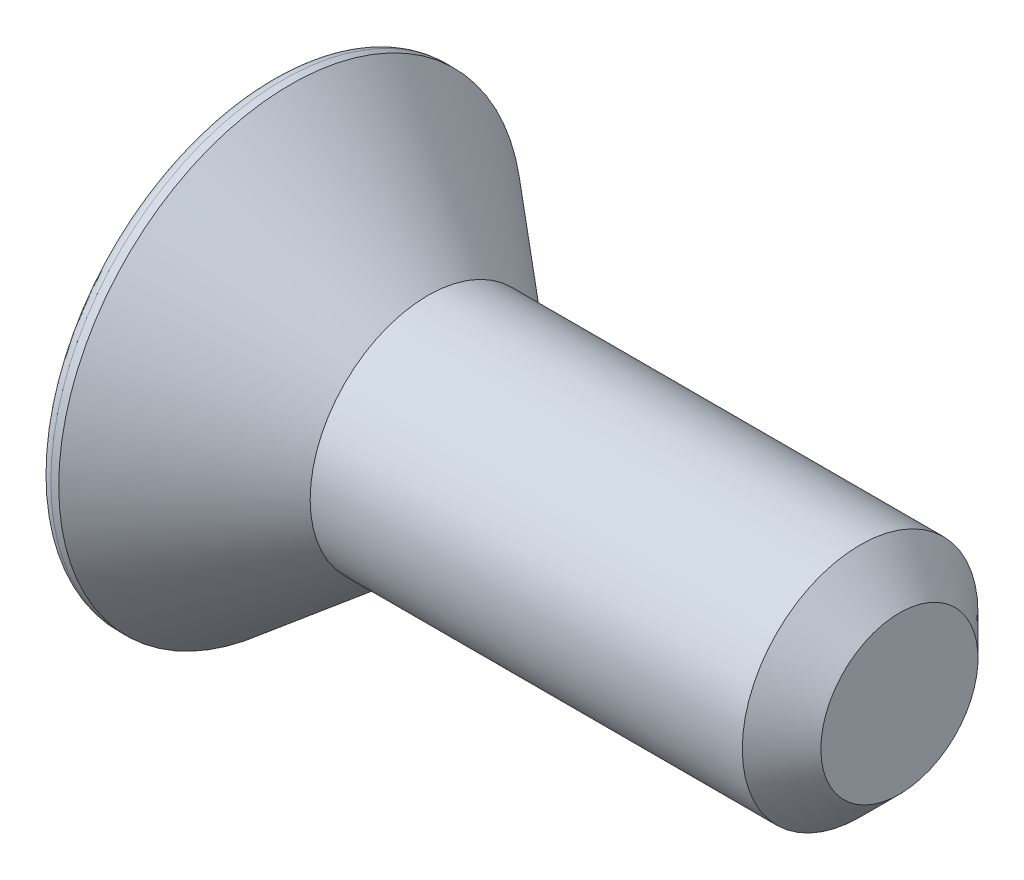
ISO-10303-21;
HEADER;
FILE_DESCRIPTION(('STEP AP214'),'2;1');
FILE_NAME('part.step','',(''),(''),'','','');
FILE_SCHEMA(('AUTOMOTIVE_DESIGN { 1 0 10303 214 1 1 1 1 }'));
ENDSEC;
DATA;
#1=APPLICATION_CONTEXT('core data for automotive mechanical design processes');
#2=APPLICATION_PROTOCOL_DEFINITION('international standard','automotive_design',2000,#1);
#3=PRODUCT_CONTEXT('',#1,'mechanical');
#4=PRODUCT('Part','Part','',(#3));
#5=PRODUCT_RELATED_PRODUCT_CATEGORY('part','',(#4));
#6=PRODUCT_DEFINITION_FORMATION('','',#4);
#7=PRODUCT_DEFINITION_CONTEXT('part definition',#1,'design');
#8=PRODUCT_DEFINITION('design','',#6,#7);
#9=PRODUCT_DEFINITION_SHAPE('','',#8);
#10=(LENGTH_UNIT() NAMED_UNIT(*) SI_UNIT(.MILLI.,.METRE.));
#11=(NAMED_UNIT(*) PLANE_ANGLE_UNIT() SI_UNIT($,.RADIAN.));
#12=(NAMED_UNIT(*) SI_UNIT($,.STERADIAN.) SOLID_ANGLE_UNIT());
#13=UNCERTAINTY_MEASURE_WITH_UNIT(LENGTH_MEASURE(1.E-05),#10,'distance_accuracy_value','');
#14=(GEOMETRIC_REPRESENTATION_CONTEXT(3) GLOBAL_UNCERTAINTY_ASSIGNED_CONTEXT((#13)) GLOBAL_UNIT_ASSIGNED_CONTEXT((#10,
#11,#12)) REPRESENTATION_CONTEXT('',''));
#15=CARTESIAN_POINT('',(0.,0.,0.));
#16=DIRECTION('',(0.,0.,1.));
#17=DIRECTION('',(1.,0.,0.));
#18=AXIS2_PLACEMENT_3D('',#15,#16,#17);
#19=CARTESIAN_POINT('',(0.,0.,0.));
#20=DIRECTION('',(1.,0.,0.));
#21=DIRECTION('',(0.,0.,-1.));
#22=AXIS2_PLACEMENT_3D('',#19,#20,#21);
#23=PLANE('',#22);
#24=CARTESIAN_POINT('',(0.,0.,0.));
#25=DIRECTION('',(1.,0.,0.));
#26=DIRECTION('',(0.,0.,-1.));
#27=AXIS2_PLACEMENT_3D('',#24,#25,#26);
#28=CIRCLE('',#27,5.6);
#29=CARTESIAN_POINT('',(0.,0.,-5.6));
#30=VERTEX_POINT('',#29);
#31=EDGE_CURVE('E153',#30,#30,#28,.F.);
#32=ORIENTED_EDGE('',*,*,#31,.T.);
#33=EDGE_LOOP('',(#32));
#34=FACE_BOUND('',#33,.T.);
#35=DIRECTION('',(0.,0.,-1.));
#36=VECTOR('',#35,1.);
#37=CARTESIAN_POINT('',(0.,2.,1.15470053837925));
#38=LINE('',#37,#36);
#39=CARTESIAN_POINT('',(0.,2.,1.15470053837925));
#40=VERTEX_POINT('',#39);
#41=CARTESIAN_POINT('',(0.,2.,-1.15470053837925));
#42=VERTEX_POINT('',#41);
#43=EDGE_CURVE('E129',#40,#42,#38,.T.);
#44=ORIENTED_EDGE('',*,*,#43,.F.);
#45=DIRECTION('',(0.,0.866025403784438,-0.5));
#46=VECTOR('',#45,1.);
#47=CARTESIAN_POINT('',(0.,0.,2.3094010767585));
#48=LINE('',#47,#46);
#49=CARTESIAN_POINT('',(0.,0.,2.3094010767585));
#50=VERTEX_POINT('',#49);
#51=EDGE_CURVE('E55',#50,#40,#48,.T.);
#52=ORIENTED_EDGE('',*,*,#51,.F.);
#53=DIRECTION('',(0.,0.866025403784438,0.5));
#54=VECTOR('',#53,1.);
#55=CARTESIAN_POINT('',(0.,-2.,1.15470053837925));
#56=LINE('',#55,#54);
#57=CARTESIAN_POINT('',(0.,-2.,1.15470053837925));
#58=VERTEX_POINT('',#57);
#59=EDGE_CURVE('E138',#58,#50,#56,.T.);
#60=ORIENTED_EDGE('',*,*,#59,.F.);
#61=DIRECTION('',(0.,0.,1.));
#62=VECTOR('',#61,1.);
#63=CARTESIAN_POINT('',(0.,-2.,-1.15470053837925));
#64=LINE('',#63,#62);
#65=CARTESIAN_POINT('',(0.,-2.,-1.15470053837925));
#66=VERTEX_POINT('',#65);
#67=EDGE_CURVE('E136',#66,#58,#64,.T.);
#68=ORIENTED_EDGE('',*,*,#67,.F.);
#69=DIRECTION('',(0.,-0.866025403784439,0.5));
#70=VECTOR('',#69,1.);
#71=CARTESIAN_POINT('',(0.,0.,-2.3094010767585));
#72=LINE('',#71,#70);
#73=CARTESIAN_POINT('',(0.,0.,-2.3094010767585));
#74=VERTEX_POINT('',#73);
#75=EDGE_CURVE('E103',#74,#66,#72,.T.);
#76=ORIENTED_EDGE('',*,*,#75,.F.);
#77=DIRECTION('',(0.,-0.866025403784439,-0.5));
#78=VECTOR('',#77,1.);
#79=CARTESIAN_POINT('',(0.,2.,-1.15470053837925));
#80=LINE('',#79,#78);
#81=EDGE_CURVE('E132',#42,#74,#80,.T.);
#82=ORIENTED_EDGE('',*,*,#81,.F.);
#83=EDGE_LOOP('',(#44,#52,#60,#68,#76,#82));
#84=FACE_BOUND('',#83,.T.);
#85=ADVANCED_FACE('F39',(#34,#84),#23,.F.);
#86=CARTESIAN_POINT('',(0.,0.,0.));
#87=DIRECTION('',(-1.,0.,0.));
#88=DIRECTION('',(0.,0.,1.));
#89=AXIS2_PLACEMENT_3D('',#86,#87,#88);
#90=CYLINDRICAL_SURFACE('',#89,5.9);
#91=CARTESIAN_POINT('',(0.3,0.,0.));
#92=DIRECTION('',(1.,0.,0.));
#93=DIRECTION('',(0.,0.,-1.));
#94=AXIS2_PLACEMENT_3D('',#91,#92,#93);
#95=CIRCLE('',#94,5.9);
#96=CARTESIAN_POINT('',(0.3,0.,-5.9));
#97=VERTEX_POINT('',#96);
#98=EDGE_CURVE('E156',#97,#97,#95,.T.);
#99=ORIENTED_EDGE('',*,*,#98,.T.);
#100=EDGE_LOOP('',(#99));
#101=FACE_BOUND('',#100,.T.);
#102=CARTESIAN_POINT('',(0.5,0.,0.));
#103=DIRECTION('',(-1.,0.,0.));
#104=DIRECTION('',(0.,0.,1.));
#105=AXIS2_PLACEMENT_3D('',#102,#103,#104);
#106=CIRCLE('',#105,5.9);
#107=CARTESIAN_POINT('',(0.5,0.,5.9));
#108=VERTEX_POINT('',#107);
#109=EDGE_CURVE('E150',#108,#108,#106,.T.);
#110=ORIENTED_EDGE('',*,*,#109,.T.);
#111=EDGE_LOOP('',(#110));
#112=FACE_BOUND('',#111,.T.);
#113=ADVANCED_FACE('F173',(#101,#112),#90,.T.);
#114=CARTESIAN_POINT('',(4.,0.,0.));
#115=DIRECTION('',(-1.,0.,0.));
#116=DIRECTION('',(0.,0.,1.));
#117=AXIS2_PLACEMENT_3D('',#114,#115,#116);
#118=CONICAL_SURFACE('',#117,3.,0.691921382238859);
#119=ORIENTED_EDGE('',*,*,#109,.F.);
#120=EDGE_LOOP('',(#119));
#121=FACE_BOUND('',#120,.T.);
#122=CARTESIAN_POINT('',(4.,0.,0.));
#123=DIRECTION('',(-1.,0.,0.));
#124=DIRECTION('',(0.,0.,1.));
#125=AXIS2_PLACEMENT_3D('',#122,#123,#124);
#126=CIRCLE('',#125,3.);
#127=CARTESIAN_POINT('',(4.,0.,3.));
#128=VERTEX_POINT('',#127);
#129=EDGE_CURVE('E142',#128,#128,#126,.T.);
#130=ORIENTED_EDGE('',*,*,#129,.T.);
#131=EDGE_LOOP('',(#130));
#132=FACE_BOUND('',#131,.T.);
#133=ADVANCED_FACE('F179',(#121,#132),#118,.T.);
#134=CARTESIAN_POINT('',(0.,0.,0.));
#135=DIRECTION('',(-1.,0.,0.));
#136=DIRECTION('',(0.,0.,1.));
#137=AXIS2_PLACEMENT_3D('',#134,#135,#136);
#138=CYLINDRICAL_SURFACE('',#137,3.);
#139=CARTESIAN_POINT('',(15.,0.,0.));
#140=DIRECTION('',(-1.,0.,0.));
#141=DIRECTION('',(0.,0.,1.));
#142=AXIS2_PLACEMENT_3D('',#139,#140,#141);
#143=CIRCLE('',#142,3.);
#144=CARTESIAN_POINT('',(15.,0.,3.));
#145=VERTEX_POINT('',#144);
#146=EDGE_CURVE('E48',#145,#145,#143,.T.);
#147=ORIENTED_EDGE('',*,*,#146,.T.);
#148=EDGE_LOOP('',(#147));
#149=FACE_BOUND('',#148,.T.);
#150=ORIENTED_EDGE('',*,*,#129,.F.);
#151=EDGE_LOOP('',(#150));
#152=FACE_BOUND('',#151,.T.);
#153=ADVANCED_FACE('F161',(#149,#152),#138,.T.);
#154=CARTESIAN_POINT('',(16.,3.,0.));
#155=DIRECTION('',(-1.,0.,0.));
#156=DIRECTION('',(0.,0.,1.));
#157=AXIS2_PLACEMENT_3D('',#154,#155,#156);
#158=PLANE('',#157);
#159=CARTESIAN_POINT('',(16.,0.,0.));
#160=DIRECTION('',(-1.,0.,0.));
#161=DIRECTION('',(0.,0.,1.));
#162=AXIS2_PLACEMENT_3D('',#159,#160,#161);
#163=CIRCLE('',#162,1.99999999999998);
#164=CARTESIAN_POINT('',(16.,0.,1.99999999999998));
#165=VERTEX_POINT('',#164);
#166=EDGE_CURVE('E11',#165,#165,#163,.F.);
#167=ORIENTED_EDGE('',*,*,#166,.T.);
#168=EDGE_LOOP('',(#167));
#169=FACE_BOUND('',#168,.T.);
#170=ADVANCED_FACE('F189',(#169),#158,.F.);
#171=CARTESIAN_POINT('',(3.,0.,2.3094010767585));
#172=DIRECTION('',(0.,0.5,0.866025403784439));
#173=DIRECTION('',(0.,-0.866025403784439,0.5));
#174=AXIS2_PLACEMENT_3D('',#171,#172,#173);
#175=PLANE('',#174);
#176=ORIENTED_EDGE('',*,*,#51,.T.);
#177=DIRECTION('',(-1.,0.,0.));
#178=VECTOR('',#177,1.);
#179=CARTESIAN_POINT('',(3.,2.,1.15470053837925));
#180=LINE('',#179,#178);
#181=CARTESIAN_POINT('',(3.,2.,1.15470053837925));
#182=VERTEX_POINT('',#181);
#183=EDGE_CURVE('E85',#182,#40,#180,.T.);
#184=ORIENTED_EDGE('',*,*,#183,.F.);
#185=DIRECTION('',(0.,0.866025403784438,-0.5));
#186=VECTOR('',#185,1.);
#187=CARTESIAN_POINT('',(3.,0.,2.3094010767585));
#188=LINE('',#187,#186);
#189=CARTESIAN_POINT('',(3.,0.,2.3094010767585));
#190=VERTEX_POINT('',#189);
#191=EDGE_CURVE('E140',#190,#182,#188,.T.);
#192=ORIENTED_EDGE('',*,*,#191,.F.);
#193=DIRECTION('',(-1.,0.,0.));
#194=VECTOR('',#193,1.);
#195=CARTESIAN_POINT('',(3.,0.,2.3094010767585));
#196=LINE('',#195,#194);
#197=EDGE_CURVE('E63',#190,#50,#196,.T.);
#198=ORIENTED_EDGE('',*,*,#197,.T.);
#199=EDGE_LOOP('',(#176,#184,#192,#198));
#200=FACE_BOUND('',#199,.T.);
#201=ADVANCED_FACE('F192',(#200),#175,.F.);
#202=CARTESIAN_POINT('',(3.,-2.,1.15470053837925));
#203=DIRECTION('',(0.,-0.5,0.866025403784439));
#204=DIRECTION('',(0.,-0.866025403784439,-0.5));
#205=AXIS2_PLACEMENT_3D('',#202,#203,#204);
#206=PLANE('',#205);
#207=ORIENTED_EDGE('',*,*,#59,.T.);
#208=ORIENTED_EDGE('',*,*,#197,.F.);
#209=DIRECTION('',(0.,0.866025403784438,0.5));
#210=VECTOR('',#209,1.);
#211=CARTESIAN_POINT('',(3.,-2.,1.15470053837925));
#212=LINE('',#211,#210);
#213=CARTESIAN_POINT('',(3.,-2.,1.15470053837925));
#214=VERTEX_POINT('',#213);
#215=EDGE_CURVE('E115',#214,#190,#212,.T.);
#216=ORIENTED_EDGE('',*,*,#215,.F.);
#217=DIRECTION('',(-1.,0.,0.));
#218=VECTOR('',#217,1.);
#219=CARTESIAN_POINT('',(3.,-2.,1.15470053837925));
#220=LINE('',#219,#218);
#221=EDGE_CURVE('E107',#214,#58,#220,.T.);
#222=ORIENTED_EDGE('',*,*,#221,.T.);
#223=EDGE_LOOP('',(#207,#208,#216,#222));
#224=FACE_BOUND('',#223,.T.);
#225=ADVANCED_FACE('F196',(#224),#206,.F.);
#226=CARTESIAN_POINT('',(3.,-2.,-1.15470053837925));
#227=DIRECTION('',(0.,-1.,0.));
#228=DIRECTION('',(0.,0.,-1.));
#229=AXIS2_PLACEMENT_3D('',#226,#227,#228);
#230=PLANE('',#229);
#231=ORIENTED_EDGE('',*,*,#67,.T.);
#232=ORIENTED_EDGE('',*,*,#221,.F.);
#233=DIRECTION('',(0.,0.,1.));
#234=VECTOR('',#233,1.);
#235=CARTESIAN_POINT('',(3.,-2.,-1.15470053837925));
#236=LINE('',#235,#234);
#237=CARTESIAN_POINT('',(3.,-2.,-1.15470053837925));
#238=VERTEX_POINT('',#237);
#239=EDGE_CURVE('E111',#238,#214,#236,.T.);
#240=ORIENTED_EDGE('',*,*,#239,.F.);
#241=DIRECTION('',(-1.,0.,0.));
#242=VECTOR('',#241,1.);
#243=CARTESIAN_POINT('',(3.,-2.,-1.15470053837925));
#244=LINE('',#243,#242);
#245=EDGE_CURVE('E96',#238,#66,#244,.T.);
#246=ORIENTED_EDGE('',*,*,#245,.T.);
#247=EDGE_LOOP('',(#231,#232,#240,#246));
#248=FACE_BOUND('',#247,.T.);
#249=ADVANCED_FACE('F112',(#248),#230,.F.);
#250=CARTESIAN_POINT('',(3.,0.,-2.3094010767585));
#251=DIRECTION('',(0.,-0.5,-0.866025403784439));
#252=DIRECTION('',(0.,0.866025403784439,-0.5));
#253=AXIS2_PLACEMENT_3D('',#250,#251,#252);
#254=PLANE('',#253);
#255=ORIENTED_EDGE('',*,*,#75,.T.);
#256=ORIENTED_EDGE('',*,*,#245,.F.);
#257=DIRECTION('',(0.,-0.866025403784439,0.5));
#258=VECTOR('',#257,1.);
#259=CARTESIAN_POINT('',(3.,0.,-2.3094010767585));
#260=LINE('',#259,#258);
#261=CARTESIAN_POINT('',(3.,0.,-2.3094010767585));
#262=VERTEX_POINT('',#261);
#263=EDGE_CURVE('E100',#262,#238,#260,.T.);
#264=ORIENTED_EDGE('',*,*,#263,.F.);
#265=DIRECTION('',(-1.,0.,0.));
#266=VECTOR('',#265,1.);
#267=CARTESIAN_POINT('',(3.,0.,-2.3094010767585));
#268=LINE('',#267,#266);
#269=EDGE_CURVE('E108',#262,#74,#268,.T.);
#270=ORIENTED_EDGE('',*,*,#269,.T.);
#271=EDGE_LOOP('',(#255,#256,#264,#270));
#272=FACE_BOUND('',#271,.T.);
#273=ADVANCED_FACE('F98',(#272),#254,.F.);
#274=CARTESIAN_POINT('',(3.,2.,-1.15470053837925));
#275=DIRECTION('',(0.,0.5,-0.866025403784439));
#276=DIRECTION('',(0.,0.866025403784439,0.5));
#277=AXIS2_PLACEMENT_3D('',#274,#275,#276);
#278=PLANE('',#277);
#279=ORIENTED_EDGE('',*,*,#81,.T.);
#280=ORIENTED_EDGE('',*,*,#269,.F.);
#281=DIRECTION('',(0.,-0.866025403784439,-0.5));
#282=VECTOR('',#281,1.);
#283=CARTESIAN_POINT('',(3.,2.,-1.15470053837925));
#284=LINE('',#283,#282);
#285=CARTESIAN_POINT('',(3.,2.,-1.15470053837925));
#286=VERTEX_POINT('',#285);
#287=EDGE_CURVE('E121',#286,#262,#284,.T.);
#288=ORIENTED_EDGE('',*,*,#287,.F.);
#289=DIRECTION('',(-1.,0.,0.));
#290=VECTOR('',#289,1.);
#291=CARTESIAN_POINT('',(3.,2.,-1.15470053837925));
#292=LINE('',#291,#290);
#293=EDGE_CURVE('E145',#286,#42,#292,.T.);
#294=ORIENTED_EDGE('',*,*,#293,.T.);
#295=EDGE_LOOP('',(#279,#280,#288,#294));
#296=FACE_BOUND('',#295,.T.);
#297=ADVANCED_FACE('F200',(#296),#278,.F.);
#298=CARTESIAN_POINT('',(3.,2.,1.15470053837925));
#299=DIRECTION('',(0.,1.,0.));
#300=DIRECTION('',(0.,0.,1.));
#301=AXIS2_PLACEMENT_3D('',#298,#299,#300);
#302=PLANE('',#301);
#303=ORIENTED_EDGE('',*,*,#43,.T.);
#304=ORIENTED_EDGE('',*,*,#293,.F.);
#305=DIRECTION('',(0.,0.,-1.));
#306=VECTOR('',#305,1.);
#307=CARTESIAN_POINT('',(3.,2.,1.15470053837925));
#308=LINE('',#307,#306);
#309=EDGE_CURVE('E123',#182,#286,#308,.T.);
#310=ORIENTED_EDGE('',*,*,#309,.F.);
#311=ORIENTED_EDGE('',*,*,#183,.T.);
#312=EDGE_LOOP('',(#303,#304,#310,#311));
#313=FACE_BOUND('',#312,.T.);
#314=ADVANCED_FACE('F197',(#313),#302,.F.);
#315=CARTESIAN_POINT('',(3.,0.,0.));
#316=DIRECTION('',(-1.,0.,0.));
#317=DIRECTION('',(0.,0.,1.));
#318=AXIS2_PLACEMENT_3D('',#315,#316,#317);
#319=PLANE('',#318);
#320=ORIENTED_EDGE('',*,*,#191,.T.);
#321=ORIENTED_EDGE('',*,*,#309,.T.);
#322=ORIENTED_EDGE('',*,*,#287,.T.);
#323=ORIENTED_EDGE('',*,*,#263,.T.);
#324=ORIENTED_EDGE('',*,*,#239,.T.);
#325=ORIENTED_EDGE('',*,*,#215,.T.);
#326=EDGE_LOOP('',(#320,#321,#322,#323,#324,#325));
#327=FACE_BOUND('',#326,.T.);
#328=ADVANCED_FACE('F118',(#327),#319,.T.);
#329=CARTESIAN_POINT('',(0.3,0.,0.));
#330=DIRECTION('',(1.,0.,0.));
#331=DIRECTION('',(0.,0.,-1.));
#332=AXIS2_PLACEMENT_3D('',#329,#330,#331);
#333=TOROIDAL_SURFACE('',#332,5.6,0.3);
#334=ORIENTED_EDGE('',*,*,#98,.F.);
#335=EDGE_LOOP('',(#334));
#336=FACE_BOUND('',#335,.T.);
#337=ORIENTED_EDGE('',*,*,#31,.F.);
#338=EDGE_LOOP('',(#337));
#339=FACE_BOUND('',#338,.T.);
#340=ADVANCED_FACE('F165',(#336,#339),#333,.T.);
#341=CARTESIAN_POINT('',(15.,0.,0.));
#342=DIRECTION('',(-1.,0.,0.));
#343=DIRECTION('',(0.,0.,1.));
#344=AXIS2_PLACEMENT_3D('',#341,#342,#343);
#345=CONICAL_SURFACE('',#344,3.,0.785398163397453);
#346=ORIENTED_EDGE('',*,*,#166,.F.);
#347=EDGE_LOOP('',(#346));
#348=FACE_BOUND('',#347,.T.);
#349=ORIENTED_EDGE('',*,*,#146,.F.);
#350=EDGE_LOOP('',(#349));
#351=FACE_BOUND('',#350,.T.);
#352=ADVANCED_FACE('F42',(#348,#351),#345,.T.);
#353=CLOSED_SHELL('',(#85,#113,#133,#153,#170,#201,#225,#249,#273,#297,#314,#328,#340,#352));
#354=MANIFOLD_SOLID_BREP('B2',#353);
#355=ADVANCED_BREP_SHAPE_REPRESENTATION('',(#18,#354),#14);
#356=SHAPE_DEFINITION_REPRESENTATION(#9,#355);
ENDSEC;
END-ISO-10303-21;
